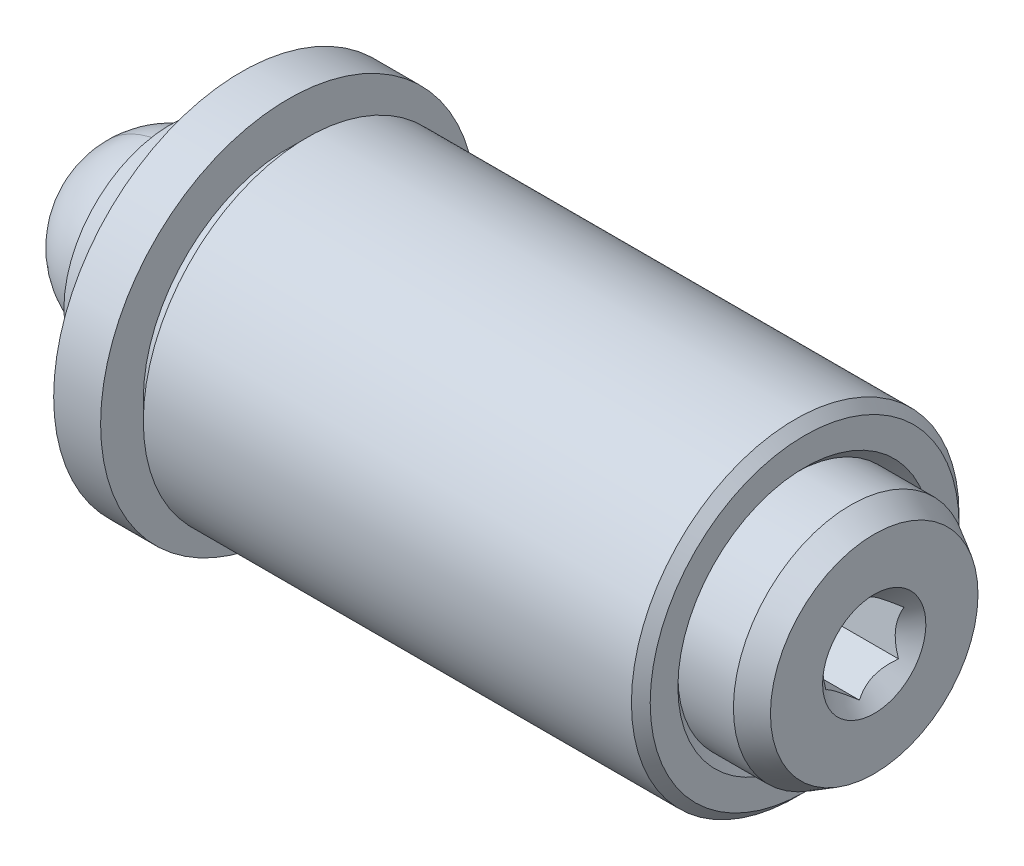
ISO-10303-21;
HEADER;
FILE_DESCRIPTION(('STEP AP214'),'2;1');
FILE_NAME('part.step','',(''),(''),'','','');
FILE_SCHEMA(('AUTOMOTIVE_DESIGN { 1 0 10303 214 1 1 1 1 }'));
ENDSEC;
DATA;
#1=APPLICATION_CONTEXT('core data for automotive mechanical design processes');
#2=APPLICATION_PROTOCOL_DEFINITION('international standard','automotive_design',2000,#1);
#3=PRODUCT_CONTEXT('',#1,'mechanical');
#4=PRODUCT('Part','Part','',(#3));
#5=PRODUCT_RELATED_PRODUCT_CATEGORY('part','',(#4));
#6=PRODUCT_DEFINITION_FORMATION('','',#4);
#7=PRODUCT_DEFINITION_CONTEXT('part definition',#1,'design');
#8=PRODUCT_DEFINITION('design','',#6,#7);
#9=PRODUCT_DEFINITION_SHAPE('','',#8);
#10=(LENGTH_UNIT() NAMED_UNIT(*) SI_UNIT(.MILLI.,.METRE.));
#11=(NAMED_UNIT(*) PLANE_ANGLE_UNIT() SI_UNIT($,.RADIAN.));
#12=(NAMED_UNIT(*) SI_UNIT($,.STERADIAN.) SOLID_ANGLE_UNIT());
#13=UNCERTAINTY_MEASURE_WITH_UNIT(LENGTH_MEASURE(1.E-05),#10,'distance_accuracy_value','');
#14=(GEOMETRIC_REPRESENTATION_CONTEXT(3) GLOBAL_UNCERTAINTY_ASSIGNED_CONTEXT((#13)) GLOBAL_UNIT_ASSIGNED_CONTEXT((#10,
#11,#12)) REPRESENTATION_CONTEXT('',''));
#15=CARTESIAN_POINT('',(0.,0.,0.));
#16=DIRECTION('',(0.,0.,1.));
#17=DIRECTION('',(1.,0.,0.));
#18=AXIS2_PLACEMENT_3D('',#15,#16,#17);
#19=CARTESIAN_POINT('',(18.5603899447571,4.09217519943124,1.49213645625379));
#20=DIRECTION('',(1.,0.,0.));
#21=DIRECTION('',(0.,-0.129580067804757,-0.991568961811389));
#22=AXIS2_PLACEMENT_3D('',#19,#20,#21);
#23=PLANE('',#22);
#24=CARTESIAN_POINT('',(18.5603899447571,0.94394374568009,1.90355317153389));
#25=DIRECTION('',(1.,0.,0.));
#26=DIRECTION('',(0.,-0.129580067804757,-0.991568961811389));
#27=AXIS2_PLACEMENT_3D('',#24,#25,#26);
#28=CIRCLE('',#27,2.80838257906458);
#29=CARTESIAN_POINT('',(18.5603899447571,0.580033340663203,-0.881151826758366));
#30=VERTEX_POINT('',#29);
#31=EDGE_CURVE('P0_E29',#30,#30,#28,.T.);
#32=ORIENTED_EDGE('',*,*,#31,.T.);
#33=EDGE_LOOP('',(#32));
#34=FACE_BOUND('',#33,.T.);
#35=CARTESIAN_POINT('',(18.5603899447571,0.94394374568009,1.90355317153389));
#36=DIRECTION('',(-1.,0.,0.));
#37=DIRECTION('',(0.,0.129580067804757,0.991568961811389));
#38=AXIS2_PLACEMENT_3D('',#35,#36,#37);
#39=CIRCLE('',#38,1.397);
#40=CARTESIAN_POINT('',(18.5603899447571,1.12496710040334,3.2887750111844));
#41=VERTEX_POINT('',#40);
#42=EDGE_CURVE('P0_E185',#41,#41,#39,.T.);
#43=ORIENTED_EDGE('',*,*,#42,.T.);
#44=EDGE_LOOP('',(#43));
#45=FACE_BOUND('',#44,.T.);
#46=ADVANCED_FACE('P0_F16',(#34,#45),#23,.T.);
#47=CARTESIAN_POINT('',(-0.489610055242887,0.94394374568009,1.90355317153389));
#48=DIRECTION('',(-1.,0.,0.));
#49=DIRECTION('',(0.,0.129580067804757,0.991568961811389));
#50=AXIS2_PLACEMENT_3D('',#47,#48,#49);
#51=CYLINDRICAL_SURFACE('',#50,3.175);
#52=CARTESIAN_POINT('',(17.9253899447571,0.94394374568009,1.90355317153389));
#53=DIRECTION('',(1.,0.,0.));
#54=DIRECTION('',(0.,-0.129580067804757,-0.991568961811389));
#55=AXIS2_PLACEMENT_3D('',#52,#53,#54);
#56=CIRCLE('',#55,3.175);
#57=CARTESIAN_POINT('',(17.9253899447571,0.532527030399986,-1.24467828221727));
#58=VERTEX_POINT('',#57);
#59=EDGE_CURVE('P0_E211',#58,#58,#56,.F.);
#60=ORIENTED_EDGE('',*,*,#59,.T.);
#61=EDGE_LOOP('',(#60));
#62=FACE_BOUND('',#61,.T.);
#63=CARTESIAN_POINT('',(0.623919492195929,0.94394374568009,1.90355317153389));
#64=DIRECTION('',(-1.,0.,0.));
#65=DIRECTION('',(0.,0.129580067804757,0.991568961811389));
#66=AXIS2_PLACEMENT_3D('',#63,#64,#65);
#67=CIRCLE('',#66,3.175);
#68=CARTESIAN_POINT('',(0.623919492195928,1.35536046096019,5.05178462528505));
#69=VERTEX_POINT('',#68);
#70=EDGE_CURVE('P0_E208',#69,#69,#67,.T.);
#71=ORIENTED_EDGE('',*,*,#70,.F.);
#72=EDGE_LOOP('',(#71));
#73=FACE_BOUND('',#72,.T.);
#74=ADVANCED_FACE('P0_F89',(#62,#73),#51,.T.);
#75=CARTESIAN_POINT('',(-0.489610055242887,0.94394374568009,1.90355317153389));
#76=DIRECTION('',(1.,0.,0.));
#77=DIRECTION('',(0.,-0.129580067804757,-0.991568961811389));
#78=AXIS2_PLACEMENT_3D('',#75,#76,#77);
#79=CONICAL_SURFACE('',#78,2.87663065701558,0.261799387799143);
#80=ORIENTED_EDGE('',*,*,#70,.T.);
#81=EDGE_LOOP('',(#80));
#82=FACE_BOUND('',#81,.T.);
#83=CARTESIAN_POINT('',(-0.489610055242887,0.94394374568009,1.90355317153389));
#84=DIRECTION('',(-1.,0.,0.));
#85=DIRECTION('',(0.,0.129580067804757,0.991568961811389));
#86=AXIS2_PLACEMENT_3D('',#83,#84,#85);
#87=CIRCLE('',#86,2.87663065701558);
#88=CARTESIAN_POINT('',(-0.489610055242887,1.31669774126541,4.75593084562565));
#89=VERTEX_POINT('',#88);
#90=EDGE_CURVE('P0_E204',#89,#89,#87,.T.);
#91=ORIENTED_EDGE('',*,*,#90,.F.);
#92=EDGE_LOOP('',(#91));
#93=FACE_BOUND('',#92,.T.);
#94=ADVANCED_FACE('P0_F95',(#82,#93),#79,.T.);
#95=CARTESIAN_POINT('',(-0.489610055242887,3.79632141977184,1.53079917594857));
#96=DIRECTION('',(-1.,0.,0.));
#97=DIRECTION('',(0.,0.129580067804757,0.991568961811389));
#98=AXIS2_PLACEMENT_3D('',#95,#96,#97);
#99=PLANE('',#98);
#100=ORIENTED_EDGE('',*,*,#90,.T.);
#101=EDGE_LOOP('',(#100));
#102=FACE_BOUND('',#101,.T.);
#103=CARTESIAN_POINT('',(-0.489610055242887,0.94394374568009,1.90355317153389));
#104=DIRECTION('',(-1.,0.,0.));
#105=DIRECTION('',(0.,0.129580067804757,0.991568961811389));
#106=AXIS2_PLACEMENT_3D('',#103,#104,#105);
#107=CIRCLE('',#106,2.74963065701558);
#108=CARTESIAN_POINT('',(-0.489610055242887,1.30024107265421,4.6300015874756));
#109=VERTEX_POINT('',#108);
#110=EDGE_CURVE('P0_E201',#109,#109,#107,.T.);
#111=ORIENTED_EDGE('',*,*,#110,.F.);
#112=EDGE_LOOP('',(#111));
#113=FACE_BOUND('',#112,.T.);
#114=ADVANCED_FACE('P0_F103',(#102,#113),#99,.T.);
#115=CARTESIAN_POINT('',(0.701014944757101,0.94394374568009,1.90355317153389));
#116=DIRECTION('',(-1.,0.,0.));
#117=DIRECTION('',(0.,0.129580067804757,0.991568961811389));
#118=AXIS2_PLACEMENT_3D('',#115,#116,#117);
#119=CONICAL_SURFACE('',#118,2.0622229927617,0.523598775598294);
#120=ORIENTED_EDGE('',*,*,#110,.T.);
#121=EDGE_LOOP('',(#120));
#122=FACE_BOUND('',#121,.T.);
#123=CARTESIAN_POINT('',(4.27288994475716,0.94394374568009,1.90355317153389));
#124=VERTEX_POINT('',#123);
#125=VERTEX_LOOP('',#124);
#126=FACE_BOUND('',#125,.T.);
#127=ADVANCED_FACE('P0_F107',(#122,#126),#119,.F.);
#128=CARTESIAN_POINT('',(17.9253899447571,0.94394374568009,1.90355317153389));
#129=DIRECTION('',(-1.,0.,0.));
#130=DIRECTION('',(0.,0.129580067804757,0.991568961811389));
#131=AXIS2_PLACEMENT_3D('',#128,#129,#130);
#132=CONICAL_SURFACE('',#131,3.175,0.5235987755983);
#133=ORIENTED_EDGE('',*,*,#31,.F.);
#134=EDGE_LOOP('',(#133));
#135=FACE_BOUND('',#134,.T.);
#136=ORIENTED_EDGE('',*,*,#59,.F.);
#137=EDGE_LOOP('',(#136));
#138=FACE_BOUND('',#137,.T.);
#139=ADVANCED_FACE('P0_F18',(#135,#138),#132,.T.);
#140=CARTESIAN_POINT('',(18.5603899447571,0.94394374568009,1.90355317153389));
#141=DIRECTION('',(1.,0.,0.));
#142=DIRECTION('',(0.,-0.129580067804757,-0.991568961811389));
#143=AXIS2_PLACEMENT_3D('',#140,#141,#142);
#144=CONICAL_SURFACE('',#143,1.397,0.785398163397454);
#145=ORIENTED_EDGE('',*,*,#42,.F.);
#146=EDGE_LOOP('',(#145));
#147=FACE_BOUND('',#146,.T.);
#148=CARTESIAN_POINT('',(18.3073517856125,2.07828669924681,1.75551683468761));
#149=CARTESIAN_POINT('',(18.2877005812141,2.05437478713902,1.72429257695661));
#150=CARTESIAN_POINT('',(18.2692030774945,2.03006303149219,1.6925462021461));
#151=CARTESIAN_POINT('',(18.2353339613897,1.98048836993165,1.62781143720904));
#152=CARTESIAN_POINT('',(18.2199812043983,1.95522074459475,1.59481688444332));
#153=CARTESIAN_POINT('',(18.1936814746021,1.90426962670837,1.52828473806391));
#154=CARTESIAN_POINT('',(18.182668363484,1.87859912429661,1.4947641070171));
#155=CARTESIAN_POINT('',(18.1656993440155,1.82669311739568,1.42698506325196));
#156=CARTESIAN_POINT('',(18.1597307624612,1.80045919958956,1.39272872242987));
#157=CARTESIAN_POINT('',(18.1543476595071,1.75524834288071,1.33369222899711));
#158=CARTESIAN_POINT('',(18.1535515846641,1.73633022632607,1.3089888868125));
#159=CARTESIAN_POINT('',(18.1548886350066,1.69853062755565,1.25963003968994));
#160=CARTESIAN_POINT('',(18.1570224064318,1.67964915434233,1.23497454650746));
#161=CARTESIAN_POINT('',(18.1676775111347,1.62327436154092,1.16136014662057));
#162=CARTESIAN_POINT('',(18.1804538430979,1.58606159594686,1.11276758829423));
#163=CARTESIAN_POINT('',(18.2112875346942,1.52074902070795,1.02748220111388));
#164=CARTESIAN_POINT('',(18.2277287563007,1.49234293992371,0.990389442344246));
#165=CARTESIAN_POINT('',(18.2647648468754,1.43664340177375,0.917656792322272));
#166=CARTESIAN_POINT('',(18.2853462011713,1.40934666295384,0.882012616135669));
#167=CARTESIAN_POINT('',(18.3073517856125,1.38254258849361,0.847011762777956));
#168=B_SPLINE_CURVE_WITH_KNOTS('',3,(#148,#149,#150,#151,#152,#153,#154,#155,#156,#157,#158,
#159,#160,#161,#162,#163,#164,#165,#166,#167),.UNSPECIFIED.,.F.,.F.,(4,2,2,2,2,2,2,2,2,4),(0.,
0.13198575731363,0.264741099720078,0.395386727542093,0.525703154748065,0.618943658290852,
0.712204731307291,0.898780059957002,1.04716773824742,1.19507867219892),.UNSPECIFIED.);
#169=CARTESIAN_POINT('',(18.3072362980756,2.07814628671184,1.75533348351266));
#170=VERTEX_POINT('',#169);
#171=CARTESIAN_POINT('',(18.3072362980756,1.38268300102858,0.847195113952912));
#172=VERTEX_POINT('',#171);
#173=EDGE_CURVE('P0_E121',#170,#172,#168,.T.);
#174=ORIENTED_EDGE('',*,*,#173,.T.);
#175=CARTESIAN_POINT('',(20.8662117468719,-2.72219416481948,1.3836280621052));
#176=CARTESIAN_POINT('',(20.7783559337374,-2.63177528661937,1.3718119556928));
#177=CARTESIAN_POINT('',(20.6906168016806,-2.54124440957363,1.35998121306388));
#178=CARTESIAN_POINT('',(20.5154506195327,-2.35987532232288,1.33627956493978));
#179=CARTESIAN_POINT('',(20.4280235896824,-2.26903709290326,1.32440865693359));
#180=CARTESIAN_POINT('',(20.2533065653142,-2.08670493490405,1.30058115294096));
#181=CARTESIAN_POINT('',(20.1660177939434,-1.9952098527075,1.28862440619772));
#182=CARTESIAN_POINT('',(19.9919799649044,-1.81172467634252,1.26464622363026));
#183=CARTESIAN_POINT('',(19.905230880555,-1.71973460707152,1.25262479105968));
#184=CARTESIAN_POINT('',(19.7219152566224,-1.52382566211996,1.2270230474109));
#185=CARTESIAN_POINT('',(19.6254421178194,-1.41982061235407,1.21343147494368));
#186=CARTESIAN_POINT('',(19.4338131349764,-1.21059079133415,1.18608893454689));
#187=CARTESIAN_POINT('',(19.338657511709,-1.10536582096143,1.1723379405961));
#188=CARTESIAN_POINT('',(19.1505531622176,-0.89330071346608,1.14462487971321));
#189=CARTESIAN_POINT('',(19.0576008914687,-0.786463697517689,1.13066322066192));
#190=CARTESIAN_POINT('',(18.920775555709,-0.624072270221502,1.10944160827753));
#191=CARTESIAN_POINT('',(18.8756070310923,-0.569593503570057,1.10232222218489));
#192=CARTESIAN_POINT('',(18.7864474497029,-0.459699090228733,1.08796101678157));
#193=CARTESIAN_POINT('',(18.742456312584,-0.404283507891465,1.0807192058806));
#194=CARTESIAN_POINT('',(18.6506872948646,-0.285217462974775,1.06515943468187));
#195=CARTESIAN_POINT('',(18.6031235514784,-0.221403601285702,1.05682012108592));
#196=CARTESIAN_POINT('',(18.5109808292105,-0.0915212607937024,1.0398468563552));
#197=CARTESIAN_POINT('',(18.4664061947419,-0.0254497023709741,1.03121250277001));
#198=CARTESIAN_POINT('',(18.3828062767862,0.108522484078996,1.01370476939721));
#199=CARTESIAN_POINT('',(18.3436983418268,0.176371706513603,1.00483810738762));
#200=CARTESIAN_POINT('',(18.2731606835718,0.315863922168795,0.98660900637803));
#201=CARTESIAN_POINT('',(18.241708391998,0.38749498796764,0.977248126075579));
#202=CARTESIAN_POINT('',(18.2061768204088,0.491341564949545,0.963677263125185));
#203=CARTESIAN_POINT('',(18.1969111081164,0.521807718945751,0.959695889713328));
#204=CARTESIAN_POINT('',(18.1808501431536,0.583383683879777,0.951649028608763));
#205=CARTESIAN_POINT('',(18.1740548051492,0.614493472545271,0.947583543826643));
#206=CARTESIAN_POINT('',(18.1633179882052,0.677022621356403,0.939412118888212));
#207=CARTESIAN_POINT('',(18.1593608275081,0.708439292816783,0.935306530094267));
#208=CARTESIAN_POINT('',(18.1544793719958,0.771513199948856,0.927063915129843));
#209=CARTESIAN_POINT('',(18.1535555745541,0.803170474218769,0.922926883915276));
#210=CARTESIAN_POINT('',(18.1547878868777,0.865638440702326,0.91476345439669));
#211=CARTESIAN_POINT('',(18.1568681025955,0.896450638434535,0.910736859348718));
#212=CARTESIAN_POINT('',(18.1638415874399,0.957766501659548,0.902723988817061));
#213=CARTESIAN_POINT('',(18.168736165122,0.988270016910301,0.898737732967286));
#214=CARTESIAN_POINT('',(18.1873192428654,1.07930118982095,0.886841610748454));
#215=CARTESIAN_POINT('',(18.2048973207418,1.13905614373728,0.879032722735256));
#216=CARTESIAN_POINT('',(18.2506235501682,1.26429678672209,0.862666043628805));
#217=CARTESIAN_POINT('',(18.2799436008976,1.32933814210666,0.854166318884044));
#218=CARTESIAN_POINT('',(18.3448408376522,1.45634183146306,0.8375692416135));
#219=CARTESIAN_POINT('',(18.3804312220706,1.51829730999875,0.829472784968805));
#220=CARTESIAN_POINT('',(18.456081567725,1.6405280532131,0.813499445137144));
#221=CARTESIAN_POINT('',(18.4961935103467,1.70077110514613,0.805626771571417));
#222=CARTESIAN_POINT('',(18.5790676684766,1.8193236734929,0.790134102441537));
#223=CARTESIAN_POINT('',(18.6218271358153,1.8776351015292,0.782513857063008));
#224=CARTESIAN_POINT('',(18.710296175963,1.99432865901514,0.767264126914352));
#225=CARTESIAN_POINT('',(18.7560529965747,2.05267532559225,0.759639276498067));
#226=CARTESIAN_POINT('',(18.8489466791748,2.16828167161863,0.744531625155903));
#227=CARTESIAN_POINT('',(18.8960836746219,2.22554124506091,0.737048838083212));
#228=CARTESIAN_POINT('',(19.0390157900875,2.39613224386133,0.714755690513267));
#229=CARTESIAN_POINT('',(19.1362993941231,2.50823412134684,0.700106009608494));
#230=CARTESIAN_POINT('',(19.3333211995619,2.73065670155757,0.671039415014444));
#231=CARTESIAN_POINT('',(19.4330637609826,2.84097356499114,0.656623003050907));
#232=CARTESIAN_POINT('',(19.633982919498,3.06027036773251,0.627964890843882));
#233=CARTESIAN_POINT('',(19.7351592028275,3.16925059011032,0.613723153608283));
#234=CARTESIAN_POINT('',(19.9280912660821,3.37521303453849,0.586807600033994));
#235=CARTESIAN_POINT('',(20.0197524663954,3.47228263725855,0.574122364627606));
#236=CARTESIAN_POINT('',(20.203656146111,3.665890661937,0.548821309500236));
#237=CARTESIAN_POINT('',(20.2958986633529,3.76242904853455,0.536205494400275));
#238=CARTESIAN_POINT('',(20.4804901582464,3.95476321097293,0.511070909948975));
#239=CARTESIAN_POINT('',(20.5728376367571,4.05056040304814,0.498551955521504));
#240=CARTESIAN_POINT('',(20.7578595786184,4.24182906196116,0.473556613043663));
#241=CARTESIAN_POINT('',(20.8505340149582,4.33730055448086,0.461080221637133));
#242=CARTESIAN_POINT('',(20.9433295723533,4.43265558385644,0.448619049849908));
#243=B_SPLINE_CURVE_WITH_KNOTS('',3,(#175,#176,#177,#178,#179,#180,#181,#182,#183,#184,#185,
#186,#187,#188,#189,#190,#191,#192,#193,#194,#195,#196,#197,#198,#199,#200,#201,#202,#203,#204,
#205,#206,#207,#208,#209,#210,#211,#212,#213,#214,#215,#216,#217,#218,#219,#220,#221,#222,#223,
#224,#225,#226,#227,#228,#229,#230,#231,#232,#233,#234,#235,#236,#237,#238,#239,#240,#241,#242),
.UNSPECIFIED.,.F.,.F.,(4,2,2,2,2,2,2,2,2,2,2,2,2,2,2,2,2,2,2,2,2,2,2,2,2,2,2,2,2,2,2,2,2,4),(0.,
0.379874835988939,0.759773876203367,1.14082701041047,1.52186115387161,1.94938001736953,
2.37696967257861,2.80381700436517,3.01718157744285,3.23053155296424,3.47055378498738,
3.71091762864544,3.94712387105913,4.18262512424182,4.27881732966126,4.37500621199584,
4.47065944041731,4.56632835209357,4.65962213579648,4.75295933214986,4.94050930933201,
5.15555780798493,5.37106449029748,5.58936617401833,5.8074449376442,6.0310355674528,
6.25464788967338,6.70203244465327,7.15027722868555,7.59842538607459,8.00074953073231,
8.40310014008474,8.80404436426245,9.20495620671304),.UNSPECIFIED.);
#244=CARTESIAN_POINT('',(18.3072362980756,0.248480459996821,0.995414801974145));
#245=VERTEX_POINT('',#244);
#246=EDGE_CURVE('P0_E128',#172,#245,#243,.F.);
#247=ORIENTED_EDGE('',*,*,#246,.T.);
#248=CARTESIAN_POINT('',(18.3073517856125,0.248569040504664,0.995201525564378));
#249=CARTESIAN_POINT('',(18.2877005812141,0.233483996149195,1.03152197776829));
#250=CARTESIAN_POINT('',(18.2692030774945,0.218146706908651,1.0684497631743));
#251=CARTESIAN_POINT('',(18.2353339613897,0.186872086745411,1.14375006193827));
#252=CARTESIAN_POINT('',(18.2199812043983,0.170931778532238,1.1821297437562));
#253=CARTESIAN_POINT('',(18.1936814746021,0.138788808542558,1.25952077938672));
#254=CARTESIAN_POINT('',(18.182668363484,0.122594341711012,1.29851240212661));
#255=CARTESIAN_POINT('',(18.1656993440155,0.0898489714166529,1.3773538445944));
#256=CARTESIAN_POINT('',(18.1597307624612,0.0732990689270875,1.41720125426634));
#257=CARTESIAN_POINT('',(18.1543476595071,0.0447773942183832,1.48587325141944));
#258=CARTESIAN_POINT('',(18.1535515846641,0.0328427306054451,1.51460849203982));
#259=CARTESIAN_POINT('',(18.1548886350066,0.00899651448101511,1.57202332838915));
#260=CARTESIAN_POINT('',(18.1570224064318,-0.00291503235118681,1.600702910444));
#261=CARTESIAN_POINT('',(18.1676775111347,-0.0384795763368786,1.68633211308655));
#262=CARTESIAN_POINT('',(18.1804538430979,-0.0619555834853394,1.74285559259925));
#263=CARTESIAN_POINT('',(18.2112875346942,-0.103158607735658,1.8420606355329));
#264=CARTESIAN_POINT('',(18.2277287563007,-0.121078838734484,1.88520740249883));
#265=CARTESIAN_POINT('',(18.2647648468754,-0.156217392263098,1.96981094252674));
#266=CARTESIAN_POINT('',(18.2853462011713,-0.17343778492771,2.01127269987854));
#267=CARTESIAN_POINT('',(18.3073517856125,-0.190347375859507,2.05198613596489));
#268=B_SPLINE_CURVE_WITH_KNOTS('',3,(#248,#249,#250,#251,#252,#253,#254,#255,#256,#257,#258,
#259,#260,#261,#262,#263,#264,#265,#266,#267),.UNSPECIFIED.,.F.,.F.,(4,2,2,2,2,2,2,2,2,4),(0.,
0.13198575731363,0.264741099720079,0.395386727542094,0.525703154748067,0.618943658290854,
0.712204731307294,0.898780059957003,1.04716773824742,1.19507867219892),.UNSPECIFIED.);
#269=CARTESIAN_POINT('',(18.3072362980756,-0.190258795351664,2.05177285955512));
#270=VERTEX_POINT('',#269);
#271=EDGE_CURVE('P0_E157',#245,#270,#268,.T.);
#272=ORIENTED_EDGE('',*,*,#271,.T.);
#273=CARTESIAN_POINT('',(18.3073517856125,-0.190399207886629,2.05158950838017));
#274=CARTESIAN_POINT('',(18.2877005812141,-0.166487295778835,2.08281376611118));
#275=CARTESIAN_POINT('',(18.2692030774945,-0.142175540132007,2.11456014092168));
#276=CARTESIAN_POINT('',(18.2353339613897,-0.0926008785714696,2.17929490585874));
#277=CARTESIAN_POINT('',(18.2199812043983,-0.0673332532345671,2.21228945862447));
#278=CARTESIAN_POINT('',(18.1936814746021,-0.0163821353481907,2.27882160500387));
#279=CARTESIAN_POINT('',(18.182668363484,0.00928836706356569,2.31234223605068));
#280=CARTESIAN_POINT('',(18.1656993440155,0.0611943739645021,2.38012127981582));
#281=CARTESIAN_POINT('',(18.1597307624612,0.0874282917706231,2.41437762063791));
#282=CARTESIAN_POINT('',(18.1543476595071,0.132639148479466,2.47341411407067));
#283=CARTESIAN_POINT('',(18.1535515846641,0.151557265034105,2.49811745625528));
#284=CARTESIAN_POINT('',(18.1548886350066,0.189356863804534,2.54747630337784));
#285=CARTESIAN_POINT('',(18.1570224064318,0.208238337017851,2.57213179656032));
#286=CARTESIAN_POINT('',(18.1676775111347,0.264613129819263,2.64574619644721));
#287=CARTESIAN_POINT('',(18.1804538430979,0.301825895413316,2.69433875477355));
#288=CARTESIAN_POINT('',(18.2112875346942,0.367138470652232,2.77962414195391));
#289=CARTESIAN_POINT('',(18.2277287563007,0.395544551436474,2.81671690072353));
#290=CARTESIAN_POINT('',(18.2647648468754,0.451244089586431,2.88944955074551));
#291=CARTESIAN_POINT('',(18.2853462011713,0.478540828406337,2.92509372693211));
#292=CARTESIAN_POINT('',(18.3073517856125,0.50534490286657,2.96009458028982));
#293=B_SPLINE_CURVE_WITH_KNOTS('',3,(#273,#274,#275,#276,#277,#278,#279,#280,#281,#282,#283,
#284,#285,#286,#287,#288,#289,#290,#291,#292),.UNSPECIFIED.,.F.,.F.,(4,2,2,2,2,2,2,2,2,4),(0.,
0.13198575731363,0.264741099720079,0.395386727542093,0.525703154748064,0.618943658290851,
0.712204731307291,0.898780059957001,1.04716773824742,1.19507867219892),.UNSPECIFIED.);
#294=CARTESIAN_POINT('',(18.3072362980756,0.505204490331605,2.95991122911487));
#295=VERTEX_POINT('',#294);
#296=EDGE_CURVE('P0_E152',#270,#295,#293,.T.);
#297=ORIENTED_EDGE('',*,*,#296,.T.);
#298=CARTESIAN_POINT('',(20.8662117468719,-2.46547013448469,3.34812448924593));
#299=CARTESIAN_POINT('',(20.7783559337374,-2.37505125628458,3.33630838283352));
#300=CARTESIAN_POINT('',(20.6906168016806,-2.28452037923885,3.32447764020461));
#301=CARTESIAN_POINT('',(20.5154506195327,-2.10315129198809,3.3007759920805));
#302=CARTESIAN_POINT('',(20.4280235896824,-2.01231306256847,3.28890508407431));
#303=CARTESIAN_POINT('',(20.2533065653142,-1.82998090456926,3.26507758008168));
#304=CARTESIAN_POINT('',(20.1660177939434,-1.73848582237271,3.25312083333845));
#305=CARTESIAN_POINT('',(19.9919799649044,-1.55500064600774,3.22914265077099));
#306=CARTESIAN_POINT('',(19.905230880555,-1.46301057673674,3.2171212182004));
#307=CARTESIAN_POINT('',(19.7219152566224,-1.26710163178518,3.19151947455162));
#308=CARTESIAN_POINT('',(19.6254421178194,-1.16309658201928,3.17792790208441));
#309=CARTESIAN_POINT('',(19.4338131349764,-0.953866760999368,3.15058536168761));
#310=CARTESIAN_POINT('',(19.338657511709,-0.848641790626642,3.13683436773683));
#311=CARTESIAN_POINT('',(19.1505531622177,-0.636576683131296,3.10912130685393));
#312=CARTESIAN_POINT('',(19.0576008914687,-0.529739667182905,3.09515964780264));
#313=CARTESIAN_POINT('',(18.920775555709,-0.367348239886717,3.07393803541825));
#314=CARTESIAN_POINT('',(18.8756070310923,-0.312869473235272,3.06681864932561));
#315=CARTESIAN_POINT('',(18.7864474497029,-0.202975059893948,3.05245744392229));
#316=CARTESIAN_POINT('',(18.742456312584,-0.147559477556681,3.04521563302133));
#317=CARTESIAN_POINT('',(18.6506872948646,-0.0284934326399904,3.0296558618226));
#318=CARTESIAN_POINT('',(18.6031235514784,0.0353204290490832,3.02131654822665));
#319=CARTESIAN_POINT('',(18.5109808292105,0.165202769541083,3.00434328349592));
#320=CARTESIAN_POINT('',(18.4664061947419,0.231274327963811,2.99570892991073));
#321=CARTESIAN_POINT('',(18.3828062767862,0.365246514413782,2.97820119653793));
#322=CARTESIAN_POINT('',(18.3436983418268,0.433095736848388,2.96933453452835));
#323=CARTESIAN_POINT('',(18.2731606835718,0.57258795250358,2.95110543351875));
#324=CARTESIAN_POINT('',(18.241708391998,0.644219018302425,2.9417445532163));
#325=CARTESIAN_POINT('',(18.2061768204088,0.74806559528433,2.92817369026591));
#326=CARTESIAN_POINT('',(18.1969111081164,0.778531749280536,2.92419231685405));
#327=CARTESIAN_POINT('',(18.1808501431536,0.840107714214562,2.91614545574949));
#328=CARTESIAN_POINT('',(18.1740548051492,0.871217502880056,2.91207997096737));
#329=CARTESIAN_POINT('',(18.1633179882052,0.933746651691188,2.90390854602893));
#330=CARTESIAN_POINT('',(18.1593608275081,0.965163323151568,2.89980295723499));
#331=CARTESIAN_POINT('',(18.1544793719958,1.02823723028364,2.89156034227057));
#332=CARTESIAN_POINT('',(18.1535555745541,1.05989450455355,2.887423311056));
#333=CARTESIAN_POINT('',(18.1547878868777,1.12236247103711,2.87925988153741));
#334=CARTESIAN_POINT('',(18.1568681025955,1.15317466876932,2.87523328648944));
#335=CARTESIAN_POINT('',(18.1638415874399,1.21449053199433,2.86722041595778));
#336=CARTESIAN_POINT('',(18.168736165122,1.24499404724509,2.86323416010801));
#337=CARTESIAN_POINT('',(18.1873192428654,1.33602522015573,2.85133803788918));
#338=CARTESIAN_POINT('',(18.2048973207418,1.39578017407206,2.84352914987598));
#339=CARTESIAN_POINT('',(18.2506235501682,1.52102081705688,2.82716247076953));
#340=CARTESIAN_POINT('',(18.2799436008976,1.58606217244144,2.81866274602477));
#341=CARTESIAN_POINT('',(18.3448408376522,1.71306586179785,2.80206566875422));
#342=CARTESIAN_POINT('',(18.3804312220706,1.77502134033353,2.79396921210953));
#343=CARTESIAN_POINT('',(18.456081567725,1.89725208354788,2.77799587227787));
#344=CARTESIAN_POINT('',(18.4961935103467,1.95749513548091,2.77012319871214));
#345=CARTESIAN_POINT('',(18.5790676684766,2.07604770382769,2.75463052958226));
#346=CARTESIAN_POINT('',(18.6218271358153,2.13435913186398,2.74701028420373));
#347=CARTESIAN_POINT('',(18.710296175963,2.25105268934992,2.73176055405508));
#348=CARTESIAN_POINT('',(18.7560529965747,2.30939935592703,2.72413570363879));
#349=CARTESIAN_POINT('',(18.8489466791748,2.42500570195341,2.70902805229663));
#350=CARTESIAN_POINT('',(18.8960836746219,2.4822652753957,2.70154526522394));
#351=CARTESIAN_POINT('',(19.0390157900875,2.65285627419611,2.67925211765399));
#352=CARTESIAN_POINT('',(19.1362993941231,2.76495815168163,2.66460243674922));
#353=CARTESIAN_POINT('',(19.3333211995619,2.98738073189236,2.63553584215517));
#354=CARTESIAN_POINT('',(19.4330637609826,3.09769759532592,2.62111943019163));
#355=CARTESIAN_POINT('',(19.633982919498,3.3169943980673,2.5924613179846));
#356=CARTESIAN_POINT('',(19.7351592028275,3.42597462044511,2.57821958074901));
#357=CARTESIAN_POINT('',(19.928091266082,3.63193706487327,2.55130402717472));
#358=CARTESIAN_POINT('',(20.0197524663954,3.72900666759333,2.53861879176833));
#359=CARTESIAN_POINT('',(20.203656146111,3.92261469227178,2.51331773664096));
#360=CARTESIAN_POINT('',(20.2958986633529,4.01915307886933,2.500701921541));
#361=CARTESIAN_POINT('',(20.4804901582464,4.21148724130771,2.4755673370897));
#362=CARTESIAN_POINT('',(20.5728376367571,4.30728443338292,2.46304838266223));
#363=CARTESIAN_POINT('',(20.7578595786184,4.49855309229594,2.43805304018439));
#364=CARTESIAN_POINT('',(20.8505340149582,4.59402458481565,2.42557664877786));
#365=CARTESIAN_POINT('',(20.9433295723533,4.68937961419123,2.41311547699063));
#366=B_SPLINE_CURVE_WITH_KNOTS('',3,(#298,#299,#300,#301,#302,#303,#304,#305,#306,#307,#308,
#309,#310,#311,#312,#313,#314,#315,#316,#317,#318,#319,#320,#321,#322,#323,#324,#325,#326,#327,
#328,#329,#330,#331,#332,#333,#334,#335,#336,#337,#338,#339,#340,#341,#342,#343,#344,#345,#346,
#347,#348,#349,#350,#351,#352,#353,#354,#355,#356,#357,#358,#359,#360,#361,#362,#363,#364,#365),
.UNSPECIFIED.,.F.,.F.,(4,2,2,2,2,2,2,2,2,2,2,2,2,2,2,2,2,2,2,2,2,2,2,2,2,2,2,2,2,2,2,2,2,4),(0.,
0.379874835988939,0.759773876203367,1.14082701041047,1.52186115387161,1.94938001736953,
2.37696967257861,2.80381700436517,3.01718157744285,3.23053155296424,3.47055378498738,
3.71091762864544,3.94712387105913,4.18262512424182,4.27881732966126,4.37500621199584,
4.47065944041731,4.56632835209357,4.65962213579647,4.75295933214986,4.94050930933201,
5.15555780798492,5.37106449029748,5.58936617401833,5.8074449376442,6.0310355674528,
6.25464788967337,6.70203244465328,7.15027722868555,7.59842538607459,8.00074953073229,
8.40310014008474,8.80404436426245,9.20495620671304),.UNSPECIFIED.);
#367=CARTESIAN_POINT('',(18.3072362980756,1.63940703136336,2.81169154109363));
#368=VERTEX_POINT('',#367);
#369=EDGE_CURVE('P0_E35',#295,#368,#366,.T.);
#370=ORIENTED_EDGE('',*,*,#369,.T.);
#371=CARTESIAN_POINT('',(18.3073517856125,1.63931845085552,2.8119048175034));
#372=CARTESIAN_POINT('',(18.2877005812141,1.65440349521098,2.77558436529949));
#373=CARTESIAN_POINT('',(18.2692030774945,1.66974078445153,2.73865657989348));
#374=CARTESIAN_POINT('',(18.2353339613897,1.70101540461477,2.66335628112951));
#375=CARTESIAN_POINT('',(18.2199812043983,1.71695571282794,2.62497659931159));
#376=CARTESIAN_POINT('',(18.1936814746021,1.74909868281762,2.54758556368107));
#377=CARTESIAN_POINT('',(18.182668363484,1.76529314964917,2.50859394094117));
#378=CARTESIAN_POINT('',(18.1656993440155,1.79803851994353,2.42975249847338));
#379=CARTESIAN_POINT('',(18.1597307624612,1.81458842243309,2.38990508880144));
#380=CARTESIAN_POINT('',(18.1543476595071,1.8431100971418,2.32123309164834));
#381=CARTESIAN_POINT('',(18.1535515846641,1.85504476075473,2.29249785102796));
#382=CARTESIAN_POINT('',(18.1548886350066,1.87889097687916,2.23508301467863));
#383=CARTESIAN_POINT('',(18.1570224064318,1.89080252371137,2.20640343262379));
#384=CARTESIAN_POINT('',(18.1676775111347,1.92636706769706,2.12077422998123));
#385=CARTESIAN_POINT('',(18.1804538430979,1.94984307484552,2.06425075046854));
#386=CARTESIAN_POINT('',(18.2112875346942,1.99104609909584,1.96504570753488));
#387=CARTESIAN_POINT('',(18.2277287563007,2.00896633009466,1.92189894056896));
#388=CARTESIAN_POINT('',(18.2647648468754,2.04410488362328,1.83729540054104));
#389=CARTESIAN_POINT('',(18.2853462011713,2.06132527628789,1.79583364318924));
#390=CARTESIAN_POINT('',(18.3073517856125,2.07823486721969,1.75512020710289));
#391=B_SPLINE_CURVE_WITH_KNOTS('',3,(#371,#372,#373,#374,#375,#376,#377,#378,#379,#380,#381,
#382,#383,#384,#385,#386,#387,#388,#389,#390),.UNSPECIFIED.,.F.,.F.,(4,2,2,2,2,2,2,2,2,4),(0.,
0.13198575731363,0.264741099720078,0.395386727542093,0.525703154748067,0.618943658290854,
0.712204731307294,0.898780059957003,1.04716773824742,1.19507867219892),.UNSPECIFIED.);
#392=EDGE_CURVE('P0_E10',#368,#170,#391,.T.);
#393=ORIENTED_EDGE('',*,*,#392,.T.);
#394=EDGE_LOOP('',(#174,#247,#272,#297,#370,#393));
#395=FACE_BOUND('',#394,.T.);
#396=ADVANCED_FACE('P0_F135',(#147,#395),#144,.F.);
#397=CARTESIAN_POINT('',(15.5123899447571,2.07814628671184,1.75533348351266));
#398=DIRECTION('',(0.,0.923513944435203,0.383564850362665));
#399=DIRECTION('',(0.,-0.383564850362664,0.923513944435203));
#400=AXIS2_PLACEMENT_3D('',#397,#398,#399);
#401=PLANE('',#400);
#402=ORIENTED_EDGE('',*,*,#392,.F.);
#403=DIRECTION('',(1.,0.,0.));
#404=VECTOR('',#403,1.);
#405=CARTESIAN_POINT('',(15.5123899447571,1.63940703136336,2.81169154109363));
#406=LINE('',#405,#404);
#407=CARTESIAN_POINT('',(15.5123899447571,1.63940703136336,2.81169154109363));
#408=VERTEX_POINT('',#407);
#409=EDGE_CURVE('P0_E184',#408,#368,#406,.T.);
#410=ORIENTED_EDGE('',*,*,#409,.F.);
#411=DIRECTION('',(0.,-0.383564850362664,0.923513944435203));
#412=VECTOR('',#411,1.);
#413=CARTESIAN_POINT('',(15.5123899447571,2.07814628671184,1.75533348351266));
#414=LINE('',#413,#412);
#415=CARTESIAN_POINT('',(15.5123899447571,2.07814628671184,1.75533348351266));
#416=VERTEX_POINT('',#415);
#417=EDGE_CURVE('P0_E327',#416,#408,#414,.T.);
#418=ORIENTED_EDGE('',*,*,#417,.F.);
#419=DIRECTION('',(1.,0.,0.));
#420=VECTOR('',#419,1.);
#421=CARTESIAN_POINT('',(15.5123899447571,2.07814628671184,1.75533348351266));
#422=LINE('',#421,#420);
#423=EDGE_CURVE('P0_E194',#416,#170,#422,.T.);
#424=ORIENTED_EDGE('',*,*,#423,.T.);
#425=EDGE_LOOP('',(#402,#410,#418,#424));
#426=FACE_BOUND('',#425,.T.);
#427=ADVANCED_FACE('P0_F117',(#426),#401,.F.);
#428=CARTESIAN_POINT('',(15.5123899447571,1.63940703136336,2.81169154109363));
#429=DIRECTION('',(0.,0.129580067804757,0.991568961811389));
#430=DIRECTION('',(1.,0.,0.));
#431=AXIS2_PLACEMENT_3D('',#428,#429,#430);
#432=PLANE('',#431);
#433=ORIENTED_EDGE('',*,*,#369,.F.);
#434=DIRECTION('',(1.,0.,0.));
#435=VECTOR('',#434,1.);
#436=CARTESIAN_POINT('',(15.5123899447571,0.505204490331605,2.95991122911487));
#437=LINE('',#436,#435);
#438=CARTESIAN_POINT('',(15.5123899447571,0.505204490331606,2.95991122911487));
#439=VERTEX_POINT('',#438);
#440=EDGE_CURVE('P0_E181',#439,#295,#437,.T.);
#441=ORIENTED_EDGE('',*,*,#440,.F.);
#442=DIRECTION('',(0.,-0.991568961811388,0.129580067804757));
#443=VECTOR('',#442,1.);
#444=CARTESIAN_POINT('',(15.5123899447571,1.63940703136336,2.81169154109363));
#445=LINE('',#444,#443);
#446=EDGE_CURVE('P0_E328',#408,#439,#445,.T.);
#447=ORIENTED_EDGE('',*,*,#446,.F.);
#448=ORIENTED_EDGE('',*,*,#409,.T.);
#449=EDGE_LOOP('',(#433,#441,#447,#448));
#450=FACE_BOUND('',#449,.T.);
#451=ADVANCED_FACE('P0_F168',(#450),#432,.F.);
#452=CARTESIAN_POINT('',(15.5123899447571,0.505204490331605,2.95991122911487));
#453=DIRECTION('',(0.,-0.793933876630446,0.608004111448724));
#454=DIRECTION('',(0.,-0.608004111448724,-0.793933876630446));
#455=AXIS2_PLACEMENT_3D('',#452,#453,#454);
#456=PLANE('',#455);
#457=ORIENTED_EDGE('',*,*,#296,.F.);
#458=DIRECTION('',(1.,0.,0.));
#459=VECTOR('',#458,1.);
#460=CARTESIAN_POINT('',(15.5123899447571,-0.190258795351664,2.05177285955512));
#461=LINE('',#460,#459);
#462=CARTESIAN_POINT('',(15.5123899447571,-0.190258795351664,2.05177285955512));
#463=VERTEX_POINT('',#462);
#464=EDGE_CURVE('P0_E190',#463,#270,#461,.T.);
#465=ORIENTED_EDGE('',*,*,#464,.F.);
#466=DIRECTION('',(0.,-0.608004111448724,-0.793933876630446));
#467=VECTOR('',#466,1.);
#468=CARTESIAN_POINT('',(15.5123899447571,0.505204490331605,2.95991122911487));
#469=LINE('',#468,#467);
#470=EDGE_CURVE('P0_E189',#439,#463,#469,.T.);
#471=ORIENTED_EDGE('',*,*,#470,.F.);
#472=ORIENTED_EDGE('',*,*,#440,.T.);
#473=EDGE_LOOP('',(#457,#465,#471,#472));
#474=FACE_BOUND('',#473,.T.);
#475=ADVANCED_FACE('P0_F164',(#474),#456,.F.);
#476=CARTESIAN_POINT('',(15.5123899447571,0.248480459996821,0.995414801974145));
#477=DIRECTION('',(0.,-0.923513944435203,-0.383564850362665));
#478=DIRECTION('',(0.,0.383564850362664,-0.923513944435203));
#479=AXIS2_PLACEMENT_3D('',#476,#477,#478);
#480=PLANE('',#479);
#481=ORIENTED_EDGE('',*,*,#271,.F.);
#482=DIRECTION('',(1.,0.,0.));
#483=VECTOR('',#482,1.);
#484=CARTESIAN_POINT('',(15.5123899447571,0.248480459996821,0.995414801974145));
#485=LINE('',#484,#483);
#486=CARTESIAN_POINT('',(15.5123899447571,0.248480459996821,0.995414801974145));
#487=VERTEX_POINT('',#486);
#488=EDGE_CURVE('P0_E192',#487,#245,#485,.T.);
#489=ORIENTED_EDGE('',*,*,#488,.F.);
#490=DIRECTION('',(0.,0.383564850362664,-0.923513944435203));
#491=VECTOR('',#490,1.);
#492=CARTESIAN_POINT('',(15.5123899447571,0.248480459996821,0.995414801974145));
#493=LINE('',#492,#491);
#494=EDGE_CURVE('P0_E305',#463,#487,#493,.T.);
#495=ORIENTED_EDGE('',*,*,#494,.F.);
#496=ORIENTED_EDGE('',*,*,#464,.T.);
#497=EDGE_LOOP('',(#481,#489,#495,#496));
#498=FACE_BOUND('',#497,.T.);
#499=ADVANCED_FACE('P0_F161',(#498),#480,.F.);
#500=CARTESIAN_POINT('',(15.5123899447571,1.38268300102857,0.847195113952912));
#501=DIRECTION('',(0.,-0.129580067804757,-0.991568961811389));
#502=DIRECTION('',(-1.,0.,0.));
#503=AXIS2_PLACEMENT_3D('',#500,#501,#502);
#504=PLANE('',#503);
#505=ORIENTED_EDGE('',*,*,#246,.F.);
#506=DIRECTION('',(1.,0.,0.));
#507=VECTOR('',#506,1.);
#508=CARTESIAN_POINT('',(15.5123899447571,1.38268300102857,0.847195113952912));
#509=LINE('',#508,#507);
#510=CARTESIAN_POINT('',(15.5123899447571,1.38268300102857,0.847195113952912));
#511=VERTEX_POINT('',#510);
#512=EDGE_CURVE('P0_E205',#511,#172,#509,.T.);
#513=ORIENTED_EDGE('',*,*,#512,.F.);
#514=DIRECTION('',(0.,0.991568961811388,-0.129580067804757));
#515=VECTOR('',#514,1.);
#516=CARTESIAN_POINT('',(15.5123899447571,1.38268300102857,0.847195113952912));
#517=LINE('',#516,#515);
#518=EDGE_CURVE('P0_E200',#487,#511,#517,.T.);
#519=ORIENTED_EDGE('',*,*,#518,.F.);
#520=ORIENTED_EDGE('',*,*,#488,.T.);
#521=EDGE_LOOP('',(#505,#513,#519,#520));
#522=FACE_BOUND('',#521,.T.);
#523=ADVANCED_FACE('P0_F115',(#522),#504,.F.);
#524=CARTESIAN_POINT('',(15.5123899447571,2.07814628671184,1.75533348351266));
#525=DIRECTION('',(0.,0.793933876630446,-0.608004111448724));
#526=DIRECTION('',(0.,0.608004111448724,0.793933876630446));
#527=AXIS2_PLACEMENT_3D('',#524,#525,#526);
#528=PLANE('',#527);
#529=ORIENTED_EDGE('',*,*,#173,.F.);
#530=ORIENTED_EDGE('',*,*,#423,.F.);
#531=DIRECTION('',(0.,0.608004111448724,0.793933876630446));
#532=VECTOR('',#531,1.);
#533=CARTESIAN_POINT('',(15.5123899447571,2.07814628671184,1.75533348351266));
#534=LINE('',#533,#532);
#535=EDGE_CURVE('P0_E127',#511,#416,#534,.T.);
#536=ORIENTED_EDGE('',*,*,#535,.F.);
#537=ORIENTED_EDGE('',*,*,#512,.T.);
#538=EDGE_LOOP('',(#529,#530,#536,#537));
#539=FACE_BOUND('',#538,.T.);
#540=ADVANCED_FACE('P0_F112',(#539),#528,.F.);
#541=CARTESIAN_POINT('',(15.5123899447571,0.94394374568009,1.90355317153389));
#542=DIRECTION('',(-1.,0.,0.));
#543=DIRECTION('',(0.,0.129580067804757,0.991568961811389));
#544=AXIS2_PLACEMENT_3D('',#541,#542,#543);
#545=PLANE('',#544);
#546=ORIENTED_EDGE('',*,*,#535,.T.);
#547=CARTESIAN_POINT('',(15.5123899447571,0.94394374568009,1.90355317153389));
#548=DIRECTION('',(1.,0.,0.));
#549=DIRECTION('',(0.,-0.129580067804757,-0.991568961811389));
#550=AXIS2_PLACEMENT_3D('',#547,#548,#549);
#551=CIRCLE('',#550,1.14384635331849);
#552=EDGE_CURVE('P0_E338',#511,#416,#551,.T.);
#553=ORIENTED_EDGE('',*,*,#552,.F.);
#554=EDGE_LOOP('',(#546,#553));
#555=FACE_BOUND('',#554,.T.);
#556=ADVANCED_FACE('P0_F86',(#555),#545,.T.);
#557=ORIENTED_EDGE('',*,*,#417,.T.);
#558=EDGE_CURVE('P0_E337',#416,#408,#551,.T.);
#559=ORIENTED_EDGE('',*,*,#558,.F.);
#560=EDGE_LOOP('',(#557,#559));
#561=FACE_BOUND('',#560,.T.);
#562=ADVANCED_FACE('P0_F268',(#561),#545,.T.);
#563=ORIENTED_EDGE('',*,*,#446,.T.);
#564=EDGE_CURVE('P0_E334',#408,#439,#551,.T.);
#565=ORIENTED_EDGE('',*,*,#564,.F.);
#566=EDGE_LOOP('',(#563,#565));
#567=FACE_BOUND('',#566,.T.);
#568=ADVANCED_FACE('P0_F275',(#567),#545,.T.);
#569=ORIENTED_EDGE('',*,*,#470,.T.);
#570=EDGE_CURVE('P0_E332',#439,#463,#551,.T.);
#571=ORIENTED_EDGE('',*,*,#570,.F.);
#572=EDGE_LOOP('',(#569,#571));
#573=FACE_BOUND('',#572,.T.);
#574=ADVANCED_FACE('P0_F282',(#573),#545,.T.);
#575=ORIENTED_EDGE('',*,*,#494,.T.);
#576=EDGE_CURVE('P0_E307',#463,#487,#551,.T.);
#577=ORIENTED_EDGE('',*,*,#576,.F.);
#578=EDGE_LOOP('',(#575,#577));
#579=FACE_BOUND('',#578,.T.);
#580=ADVANCED_FACE('P0_F83',(#579),#545,.T.);
#581=ORIENTED_EDGE('',*,*,#518,.T.);
#582=EDGE_CURVE('P0_E339',#487,#511,#551,.T.);
#583=ORIENTED_EDGE('',*,*,#582,.F.);
#584=EDGE_LOOP('',(#581,#583));
#585=FACE_BOUND('',#584,.T.);
#586=ADVANCED_FACE('P0_F76',(#585),#545,.T.);
#587=CARTESIAN_POINT('',(14.3685435914386,0.94394374568009,1.90355317153389));
#588=DIRECTION('',(1.,0.,0.));
#589=DIRECTION('',(0.,-0.129580067804757,-0.991568961811389));
#590=AXIS2_PLACEMENT_3D('',#587,#588,#589);
#591=CONICAL_SURFACE('',#590,0.,0.785398163397439);
#592=ORIENTED_EDGE('',*,*,#552,.T.);
#593=ORIENTED_EDGE('',*,*,#558,.T.);
#594=ORIENTED_EDGE('',*,*,#564,.T.);
#595=ORIENTED_EDGE('',*,*,#570,.T.);
#596=ORIENTED_EDGE('',*,*,#576,.T.);
#597=ORIENTED_EDGE('',*,*,#582,.T.);
#598=EDGE_LOOP('',(#592,#593,#594,#595,#596,#597));
#599=FACE_BOUND('',#598,.T.);
#600=CARTESIAN_POINT('',(14.3685435914386,0.94394374568009,1.90355317153389));
#601=VERTEX_POINT('',#600);
#602=VERTEX_LOOP('',#601);
#603=FACE_BOUND('',#602,.T.);
#604=ADVANCED_FACE('P0_F74',(#599,#603),#591,.F.);
#605=CLOSED_SHELL('',(#46,#74,#94,#114,#127,#139,#396,#427,#451,#475,#499,#523,#540,#556,#562,
#568,#574,#580,#586,#604));
#606=MANIFOLD_SOLID_BREP('P0_B1',#605);
#607=CARTESIAN_POINT('',(-0.489610055242887,0.94394374568009,1.90355317153389));
#608=DIRECTION('',(0.,1.,0.));
#609=DIRECTION('',(0.,0.,-1.));
#610=AXIS2_PLACEMENT_3D('',#607,#608,#609);
#611=SPHERICAL_SURFACE('',#610,2.38125);
#612=CARTESIAN_POINT('',(-0.489610055242887,0.94394374568009,1.90355317153389));
#613=DIRECTION('',(1.,0.,0.));
#614=DIRECTION('',(0.,0.,-1.));
#615=AXIS2_PLACEMENT_3D('',#612,#613,#614);
#616=CIRCLE('',#615,2.38125);
#617=CARTESIAN_POINT('',(-0.489610055242886,-1.43730625431991,1.90355317153389));
#618=VERTEX_POINT('',#617);
#619=CARTESIAN_POINT('',(-0.489610055242887,3.32519374568009,1.90355317153389));
#620=VERTEX_POINT('',#619);
#621=EDGE_CURVE('P1_E39',#618,#620,#616,.T.);
#622=ORIENTED_EDGE('',*,*,#621,.T.);
#623=CARTESIAN_POINT('',(-0.489610055242887,0.94394374568009,1.90355317153389));
#624=DIRECTION('',(0.,0.,-1.));
#625=DIRECTION('',(-1.,0.,0.));
#626=AXIS2_PLACEMENT_3D('',#623,#624,#625);
#627=CIRCLE('',#626,2.38125);
#628=EDGE_CURVE('P1_E11',#620,#618,#627,.T.);
#629=ORIENTED_EDGE('',*,*,#628,.T.);
#630=EDGE_LOOP('',(#622,#629));
#631=FACE_BOUND('',#630,.T.);
#632=ADVANCED_FACE('P1_F17',(#631),#611,.T.);
#633=ORIENTED_EDGE('',*,*,#621,.F.);
#634=CARTESIAN_POINT('',(-0.489610055242887,0.94394374568009,1.90355317153389));
#635=DIRECTION('',(0.,0.,-1.));
#636=DIRECTION('',(-1.,0.,0.));
#637=AXIS2_PLACEMENT_3D('',#634,#635,#636);
#638=CIRCLE('',#637,2.38125);
#639=EDGE_CURVE('P1_E24',#618,#620,#638,.T.);
#640=ORIENTED_EDGE('',*,*,#639,.T.);
#641=EDGE_LOOP('',(#633,#640));
#642=FACE_BOUND('',#641,.T.);
#643=ADVANCED_FACE('P1_F38',(#642),#611,.T.);
#644=ORIENTED_EDGE('',*,*,#628,.F.);
#645=EDGE_CURVE('P1_E35',#620,#618,#616,.T.);
#646=ORIENTED_EDGE('',*,*,#645,.T.);
#647=EDGE_LOOP('',(#644,#646));
#648=FACE_BOUND('',#647,.T.);
#649=ADVANCED_FACE('P1_F33',(#648),#611,.T.);
#650=ORIENTED_EDGE('',*,*,#639,.F.);
#651=ORIENTED_EDGE('',*,*,#645,.F.);
#652=EDGE_LOOP('',(#650,#651));
#653=FACE_BOUND('',#652,.T.);
#654=ADVANCED_FACE('P1_F19',(#653),#611,.T.);
#655=CLOSED_SHELL('',(#632,#643,#649,#654));
#656=MANIFOLD_SOLID_BREP('P1_B1',#655);
#657=CARTESIAN_POINT('',(1.43678094983644,0.94394374568009,1.90355317153389));
#658=DIRECTION('',(-1.,0.,0.));
#659=DIRECTION('',(0.,0.,1.));
#660=AXIS2_PLACEMENT_3D('',#657,#658,#659);
#661=CYLINDRICAL_SURFACE('',#660,3.175);
#662=CARTESIAN_POINT('',(1.94478094983644,0.94394374568009,1.90355317153389));
#663=DIRECTION('',(1.,0.,0.));
#664=DIRECTION('',(0.,0.,-1.));
#665=AXIS2_PLACEMENT_3D('',#662,#663,#664);
#666=CIRCLE('',#665,3.175);
#667=CARTESIAN_POINT('',(1.94478094983644,0.94394374568009,-1.27144682846611));
#668=VERTEX_POINT('',#667);
#669=EDGE_CURVE('P2_E22',#668,#668,#666,.F.);
#670=ORIENTED_EDGE('',*,*,#669,.T.);
#671=EDGE_LOOP('',(#670));
#672=FACE_BOUND('',#671,.T.);
#673=CARTESIAN_POINT('',(16.4227809498364,0.94394374568009,1.90355317153389));
#674=DIRECTION('',(-1.,0.,0.));
#675=DIRECTION('',(0.,0.,1.));
#676=AXIS2_PLACEMENT_3D('',#673,#674,#675);
#677=CIRCLE('',#676,3.175);
#678=CARTESIAN_POINT('',(16.4227809498364,0.94394374568009,5.07855317153389));
#679=VERTEX_POINT('',#678);
#680=EDGE_CURVE('P2_E26',#679,#679,#677,.F.);
#681=ORIENTED_EDGE('',*,*,#680,.T.);
#682=EDGE_LOOP('',(#681));
#683=FACE_BOUND('',#682,.T.);
#684=ADVANCED_FACE('P2_F15',(#672,#683),#661,.F.);
#685=CARTESIAN_POINT('',(1.43678094983644,4.11894374568009,1.90355317153389));
#686=DIRECTION('',(1.,0.,0.));
#687=DIRECTION('',(0.,0.,-1.));
#688=AXIS2_PLACEMENT_3D('',#685,#686,#687);
#689=PLANE('',#688);
#690=CARTESIAN_POINT('',(1.43678094983644,0.94394374568009,1.90355317153389));
#691=DIRECTION('',(1.,0.,0.));
#692=DIRECTION('',(0.,0.,-1.));
#693=AXIS2_PLACEMENT_3D('',#690,#691,#692);
#694=CIRCLE('',#693,3.683);
#695=CARTESIAN_POINT('',(1.43678094983644,0.94394374568009,-1.77944682846611));
#696=VERTEX_POINT('',#695);
#697=EDGE_CURVE('P2_E10',#696,#696,#694,.T.);
#698=ORIENTED_EDGE('',*,*,#697,.T.);
#699=EDGE_LOOP('',(#698));
#700=FACE_BOUND('',#699,.T.);
#701=CARTESIAN_POINT('',(1.43678094983644,0.94394374568009,1.90355317153389));
#702=DIRECTION('',(-1.,0.,0.));
#703=DIRECTION('',(0.,0.,1.));
#704=AXIS2_PLACEMENT_3D('',#701,#702,#703);
#705=CIRCLE('',#704,5.08);
#706=CARTESIAN_POINT('',(1.43678094983644,0.94394374568009,6.98355317153389));
#707=VERTEX_POINT('',#706);
#708=EDGE_CURVE('P2_E41',#707,#707,#705,.T.);
#709=ORIENTED_EDGE('',*,*,#708,.T.);
#710=EDGE_LOOP('',(#709));
#711=FACE_BOUND('',#710,.T.);
#712=ADVANCED_FACE('P2_F76',(#700,#711),#689,.F.);
#713=CARTESIAN_POINT('',(1.43678094983644,0.94394374568009,1.90355317153389));
#714=DIRECTION('',(-1.,0.,0.));
#715=DIRECTION('',(0.,0.,1.));
#716=AXIS2_PLACEMENT_3D('',#713,#714,#715);
#717=CYLINDRICAL_SURFACE('',#716,5.08);
#718=ORIENTED_EDGE('',*,*,#708,.F.);
#719=EDGE_LOOP('',(#718));
#720=FACE_BOUND('',#719,.T.);
#721=CARTESIAN_POINT('',(2.70678094983644,0.94394374568009,1.90355317153389));
#722=DIRECTION('',(-1.,0.,0.));
#723=DIRECTION('',(0.,0.,1.));
#724=AXIS2_PLACEMENT_3D('',#721,#722,#723);
#725=CIRCLE('',#724,5.08);
#726=CARTESIAN_POINT('',(2.70678094983644,0.94394374568009,6.98355317153389));
#727=VERTEX_POINT('',#726);
#728=EDGE_CURVE('P2_E44',#727,#727,#725,.T.);
#729=ORIENTED_EDGE('',*,*,#728,.T.);
#730=EDGE_LOOP('',(#729));
#731=FACE_BOUND('',#730,.T.);
#732=ADVANCED_FACE('P2_F82',(#720,#731),#717,.T.);
#733=CARTESIAN_POINT('',(2.70678094983644,6.02394374568009,1.90355317153389));
#734=DIRECTION('',(-1.,0.,0.));
#735=DIRECTION('',(0.,0.,1.));
#736=AXIS2_PLACEMENT_3D('',#733,#734,#735);
#737=PLANE('',#736);
#738=ORIENTED_EDGE('',*,*,#728,.F.);
#739=EDGE_LOOP('',(#738));
#740=FACE_BOUND('',#739,.T.);
#741=CARTESIAN_POINT('',(2.70678094983644,0.94394374568009,1.90355317153389));
#742=DIRECTION('',(-1.,0.,0.));
#743=DIRECTION('',(0.,0.,1.));
#744=AXIS2_PLACEMENT_3D('',#741,#742,#743);
#745=CIRCLE('',#744,3.9243);
#746=CARTESIAN_POINT('',(2.70678094983644,0.94394374568009,5.82785317153389));
#747=VERTEX_POINT('',#746);
#748=EDGE_CURVE('P2_E47',#747,#747,#745,.T.);
#749=ORIENTED_EDGE('',*,*,#748,.T.);
#750=EDGE_LOOP('',(#749));
#751=FACE_BOUND('',#750,.T.);
#752=ADVANCED_FACE('P2_F131',(#740,#751),#737,.F.);
#753=CARTESIAN_POINT('',(1.43678094983644,0.94394374568009,1.90355317153389));
#754=DIRECTION('',(-1.,0.,0.));
#755=DIRECTION('',(0.,0.,1.));
#756=AXIS2_PLACEMENT_3D('',#753,#754,#755);
#757=CYLINDRICAL_SURFACE('',#756,3.9243);
#758=ORIENTED_EDGE('',*,*,#748,.F.);
#759=EDGE_LOOP('',(#758));
#760=FACE_BOUND('',#759,.T.);
#761=CARTESIAN_POINT('',(3.21478094983644,0.94394374568009,1.90355317153389));
#762=DIRECTION('',(-1.,0.,0.));
#763=DIRECTION('',(0.,0.,1.));
#764=AXIS2_PLACEMENT_3D('',#761,#762,#763);
#765=CIRCLE('',#764,3.9243);
#766=CARTESIAN_POINT('',(3.21478094983644,0.94394374568009,5.82785317153389));
#767=VERTEX_POINT('',#766);
#768=EDGE_CURVE('P2_E50',#767,#767,#765,.T.);
#769=ORIENTED_EDGE('',*,*,#768,.T.);
#770=EDGE_LOOP('',(#769));
#771=FACE_BOUND('',#770,.T.);
#772=ADVANCED_FACE('P2_F72',(#760,#771),#757,.T.);
#773=CARTESIAN_POINT('',(3.21478094983644,4.86824374568009,1.90355317153389));
#774=DIRECTION('',(1.,0.,0.));
#775=DIRECTION('',(0.,0.,-1.));
#776=AXIS2_PLACEMENT_3D('',#773,#774,#775);
#777=PLANE('',#776);
#778=ORIENTED_EDGE('',*,*,#768,.F.);
#779=EDGE_LOOP('',(#778));
#780=FACE_BOUND('',#779,.T.);
#781=CARTESIAN_POINT('',(3.21478094983644,0.94394374568009,1.90355317153389));
#782=DIRECTION('',(-1.,0.,0.));
#783=DIRECTION('',(0.,0.,1.));
#784=AXIS2_PLACEMENT_3D('',#781,#782,#783);
#785=CIRCLE('',#784,4.4323);
#786=CARTESIAN_POINT('',(3.21478094983644,0.94394374568009,6.33585317153389));
#787=VERTEX_POINT('',#786);
#788=EDGE_CURVE('P2_E53',#787,#787,#785,.T.);
#789=ORIENTED_EDGE('',*,*,#788,.T.);
#790=EDGE_LOOP('',(#789));
#791=FACE_BOUND('',#790,.T.);
#792=ADVANCED_FACE('P2_F57',(#780,#791),#777,.F.);
#793=CARTESIAN_POINT('',(1.43678094983644,0.94394374568009,1.90355317153389));
#794=DIRECTION('',(-1.,0.,0.));
#795=DIRECTION('',(0.,0.,1.));
#796=AXIS2_PLACEMENT_3D('',#793,#794,#795);
#797=CYLINDRICAL_SURFACE('',#796,4.4323);
#798=CARTESIAN_POINT('',(16.4227809498364,0.94394374568009,1.90355317153389));
#799=DIRECTION('',(-1.,0.,0.));
#800=DIRECTION('',(0.,0.,1.));
#801=AXIS2_PLACEMENT_3D('',#798,#799,#800);
#802=CIRCLE('',#801,4.4323);
#803=CARTESIAN_POINT('',(16.4227809498364,0.94394374568009,6.33585317153389));
#804=VERTEX_POINT('',#803);
#805=EDGE_CURVE('P2_E38',#804,#804,#802,.T.);
#806=ORIENTED_EDGE('',*,*,#805,.T.);
#807=EDGE_LOOP('',(#806));
#808=FACE_BOUND('',#807,.T.);
#809=ORIENTED_EDGE('',*,*,#788,.F.);
#810=EDGE_LOOP('',(#809));
#811=FACE_BOUND('',#810,.T.);
#812=ADVANCED_FACE('P2_F59',(#808,#811),#797,.T.);
#813=CARTESIAN_POINT('',(16.6767809498364,5.37624374568009,1.90355317153389));
#814=DIRECTION('',(-1.,0.,0.));
#815=DIRECTION('',(0.,0.,1.));
#816=AXIS2_PLACEMENT_3D('',#813,#814,#815);
#817=PLANE('',#816);
#818=CARTESIAN_POINT('',(16.6767809498364,0.94394374568009,1.90355317153389));
#819=DIRECTION('',(-1.,0.,0.));
#820=DIRECTION('',(0.,0.,1.));
#821=AXIS2_PLACEMENT_3D('',#818,#819,#820);
#822=CIRCLE('',#821,4.1783);
#823=CARTESIAN_POINT('',(16.6767809498364,0.94394374568009,6.08185317153389));
#824=VERTEX_POINT('',#823);
#825=EDGE_CURVE('P2_E30',#824,#824,#822,.F.);
#826=ORIENTED_EDGE('',*,*,#825,.T.);
#827=EDGE_LOOP('',(#826));
#828=FACE_BOUND('',#827,.T.);
#829=CARTESIAN_POINT('',(16.6767809498364,0.94394374568009,1.90355317153389));
#830=DIRECTION('',(-1.,0.,0.));
#831=DIRECTION('',(0.,0.,1.));
#832=AXIS2_PLACEMENT_3D('',#829,#830,#831);
#833=CIRCLE('',#832,3.429);
#834=CARTESIAN_POINT('',(16.6767809498364,0.94394374568009,5.33255317153389));
#835=VERTEX_POINT('',#834);
#836=EDGE_CURVE('P2_E35',#835,#835,#833,.T.);
#837=ORIENTED_EDGE('',*,*,#836,.T.);
#838=EDGE_LOOP('',(#837));
#839=FACE_BOUND('',#838,.T.);
#840=ADVANCED_FACE('P2_F61',(#828,#839),#817,.F.);
#841=CARTESIAN_POINT('',(16.4227809498364,0.94394374568009,1.90355317153389));
#842=DIRECTION('',(-1.,0.,0.));
#843=DIRECTION('',(0.,0.,1.));
#844=AXIS2_PLACEMENT_3D('',#841,#842,#843);
#845=CONICAL_SURFACE('',#844,4.4323,0.785398163397452);
#846=ORIENTED_EDGE('',*,*,#825,.F.);
#847=EDGE_LOOP('',(#846));
#848=FACE_BOUND('',#847,.T.);
#849=ORIENTED_EDGE('',*,*,#805,.F.);
#850=EDGE_LOOP('',(#849));
#851=FACE_BOUND('',#850,.T.);
#852=ADVANCED_FACE('P2_F69',(#848,#851),#845,.T.);
#853=CARTESIAN_POINT('',(16.6767809498364,0.94394374568009,1.90355317153389));
#854=DIRECTION('',(1.,0.,0.));
#855=DIRECTION('',(0.,0.,-1.));
#856=AXIS2_PLACEMENT_3D('',#853,#854,#855);
#857=CONICAL_SURFACE('',#856,3.429,0.785398163397445);
#858=ORIENTED_EDGE('',*,*,#680,.F.);
#859=EDGE_LOOP('',(#858));
#860=FACE_BOUND('',#859,.T.);
#861=ORIENTED_EDGE('',*,*,#836,.F.);
#862=EDGE_LOOP('',(#861));
#863=FACE_BOUND('',#862,.T.);
#864=ADVANCED_FACE('P2_F88',(#860,#863),#857,.F.);
#865=CARTESIAN_POINT('',(1.94478094983644,0.94394374568009,1.90355317153389));
#866=DIRECTION('',(-1.,0.,0.));
#867=DIRECTION('',(0.,0.,1.));
#868=AXIS2_PLACEMENT_3D('',#865,#866,#867);
#869=CONICAL_SURFACE('',#868,3.175,0.785398163397452);
#870=ORIENTED_EDGE('',*,*,#697,.F.);
#871=EDGE_LOOP('',(#870));
#872=FACE_BOUND('',#871,.T.);
#873=ORIENTED_EDGE('',*,*,#669,.F.);
#874=EDGE_LOOP('',(#873));
#875=FACE_BOUND('',#874,.T.);
#876=ADVANCED_FACE('P2_F17',(#872,#875),#869,.F.);
#877=CLOSED_SHELL('',(#684,#712,#732,#752,#772,#792,#812,#840,#852,#864,#876));
#878=MANIFOLD_SOLID_BREP('P2_B1',#877);
#879=ADVANCED_BREP_SHAPE_REPRESENTATION('',(#18,#606,#656,#878),#14);
#880=SHAPE_DEFINITION_REPRESENTATION(#9,#879);
ENDSEC;
END-ISO-10303-21;
